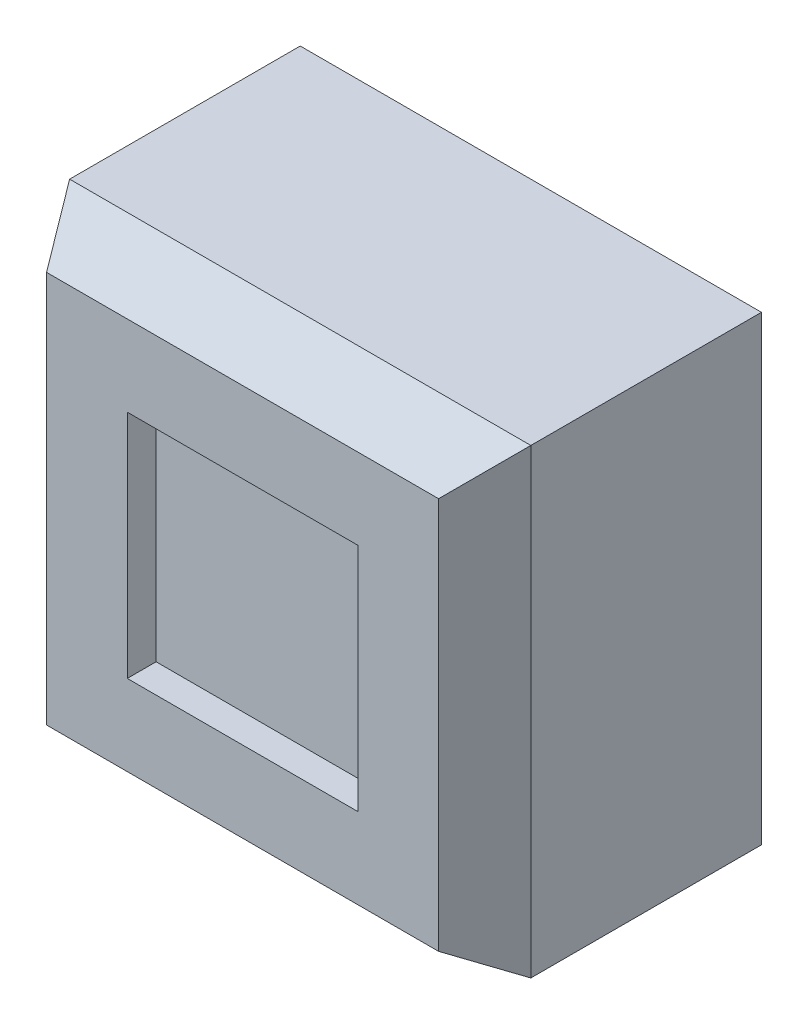
ISO-10303-21;
HEADER;
FILE_DESCRIPTION(('STEP AP214'),'2;1');
FILE_NAME('part.step','',(''),(''),'','','');
FILE_SCHEMA(('AUTOMOTIVE_DESIGN { 1 0 10303 214 1 1 1 1 }'));
ENDSEC;
DATA;
#1=APPLICATION_CONTEXT('core data for automotive mechanical design processes');
#2=APPLICATION_PROTOCOL_DEFINITION('international standard','automotive_design',2000,#1);
#3=PRODUCT_CONTEXT('',#1,'mechanical');
#4=PRODUCT('Part','Part','',(#3));
#5=PRODUCT_RELATED_PRODUCT_CATEGORY('part','',(#4));
#6=PRODUCT_DEFINITION_FORMATION('','',#4);
#7=PRODUCT_DEFINITION_CONTEXT('part definition',#1,'design');
#8=PRODUCT_DEFINITION('design','',#6,#7);
#9=PRODUCT_DEFINITION_SHAPE('','',#8);
#10=(LENGTH_UNIT() NAMED_UNIT(*) SI_UNIT(.MILLI.,.METRE.));
#11=(NAMED_UNIT(*) PLANE_ANGLE_UNIT() SI_UNIT($,.RADIAN.));
#12=(NAMED_UNIT(*) SI_UNIT($,.STERADIAN.) SOLID_ANGLE_UNIT());
#13=UNCERTAINTY_MEASURE_WITH_UNIT(LENGTH_MEASURE(1.E-05),#10,'distance_accuracy_value','');
#14=(GEOMETRIC_REPRESENTATION_CONTEXT(3) GLOBAL_UNCERTAINTY_ASSIGNED_CONTEXT((#13)) GLOBAL_UNIT_ASSIGNED_CONTEXT((#10,
#11,#12)) REPRESENTATION_CONTEXT('',''));
#15=CARTESIAN_POINT('',(0.,0.,0.));
#16=DIRECTION('',(0.,0.,1.));
#17=DIRECTION('',(1.,0.,0.));
#18=AXIS2_PLACEMENT_3D('',#15,#16,#17);
#19=CARTESIAN_POINT('',(0.,0.,10.));
#20=DIRECTION('',(1.,0.,0.));
#21=DIRECTION('',(0.,0.,-1.));
#22=AXIS2_PLACEMENT_3D('',#19,#20,#21);
#23=PLANE('',#22);
#24=DIRECTION('',(0.,0.,-1.));
#25=VECTOR('',#24,1.);
#26=CARTESIAN_POINT('',(0.,0.,10.));
#27=LINE('',#26,#25);
#28=CARTESIAN_POINT('',(0.,0.,8.));
#29=VERTEX_POINT('',#28);
#30=CARTESIAN_POINT('',(0.,0.,0.));
#31=VERTEX_POINT('',#30);
#32=EDGE_CURVE('E206',#29,#31,#27,.T.);
#33=ORIENTED_EDGE('',*,*,#32,.F.);
#34=DIRECTION('',(0.,1.,0.));
#35=VECTOR('',#34,1.);
#36=CARTESIAN_POINT('',(0.,0.,8.));
#37=LINE('',#36,#35);
#38=CARTESIAN_POINT('',(0.,16.,8.));
#39=VERTEX_POINT('',#38);
#40=EDGE_CURVE('E13',#29,#39,#37,.T.);
#41=ORIENTED_EDGE('',*,*,#40,.T.);
#42=DIRECTION('',(0.,0.,-1.));
#43=VECTOR('',#42,1.);
#44=CARTESIAN_POINT('',(0.,16.,10.));
#45=LINE('',#44,#43);
#46=CARTESIAN_POINT('',(0.,16.,0.));
#47=VERTEX_POINT('',#46);
#48=EDGE_CURVE('E197',#39,#47,#45,.T.);
#49=ORIENTED_EDGE('',*,*,#48,.T.);
#50=DIRECTION('',(0.,-1.,0.));
#51=VECTOR('',#50,1.);
#52=CARTESIAN_POINT('',(0.,0.,0.));
#53=LINE('',#52,#51);
#54=EDGE_CURVE('E176',#47,#31,#53,.T.);
#55=ORIENTED_EDGE('',*,*,#54,.T.);
#56=EDGE_LOOP('',(#33,#41,#49,#55));
#57=FACE_BOUND('',#56,.T.);
#58=ADVANCED_FACE('F48',(#57),#23,.F.);
#59=CARTESIAN_POINT('',(0.,0.,10.));
#60=DIRECTION('',(0.,1.,0.));
#61=DIRECTION('',(0.,0.,1.));
#62=AXIS2_PLACEMENT_3D('',#59,#60,#61);
#63=PLANE('',#62);
#64=DIRECTION('',(0.,0.,-1.));
#65=VECTOR('',#64,1.);
#66=CARTESIAN_POINT('',(16.,0.,10.));
#67=LINE('',#66,#65);
#68=CARTESIAN_POINT('',(16.,0.,8.));
#69=VERTEX_POINT('',#68);
#70=CARTESIAN_POINT('',(16.,0.,0.));
#71=VERTEX_POINT('',#70);
#72=EDGE_CURVE('E203',#69,#71,#67,.T.);
#73=ORIENTED_EDGE('',*,*,#72,.F.);
#74=DIRECTION('',(-1.,0.,0.));
#75=VECTOR('',#74,1.);
#76=CARTESIAN_POINT('',(0.,0.,8.));
#77=LINE('',#76,#75);
#78=EDGE_CURVE('E222',#69,#29,#77,.T.);
#79=ORIENTED_EDGE('',*,*,#78,.T.);
#80=ORIENTED_EDGE('',*,*,#32,.T.);
#81=DIRECTION('',(1.,0.,0.));
#82=VECTOR('',#81,1.);
#83=CARTESIAN_POINT('',(0.,0.,0.));
#84=LINE('',#83,#82);
#85=EDGE_CURVE('E185',#31,#71,#84,.T.);
#86=ORIENTED_EDGE('',*,*,#85,.T.);
#87=EDGE_LOOP('',(#73,#79,#80,#86));
#88=FACE_BOUND('',#87,.T.);
#89=ADVANCED_FACE('F259',(#88),#63,.F.);
#90=CARTESIAN_POINT('',(16.,0.,10.));
#91=DIRECTION('',(-1.,0.,0.));
#92=DIRECTION('',(0.,0.,1.));
#93=AXIS2_PLACEMENT_3D('',#90,#91,#92);
#94=PLANE('',#93);
#95=DIRECTION('',(0.,0.,-1.));
#96=VECTOR('',#95,1.);
#97=CARTESIAN_POINT('',(16.,16.,10.));
#98=LINE('',#97,#96);
#99=CARTESIAN_POINT('',(16.,16.,8.));
#100=VERTEX_POINT('',#99);
#101=CARTESIAN_POINT('',(16.,16.,0.));
#102=VERTEX_POINT('',#101);
#103=EDGE_CURVE('E200',#100,#102,#98,.T.);
#104=ORIENTED_EDGE('',*,*,#103,.F.);
#105=DIRECTION('',(0.,-1.,0.));
#106=VECTOR('',#105,1.);
#107=CARTESIAN_POINT('',(16.,0.,8.));
#108=LINE('',#107,#106);
#109=EDGE_CURVE('E226',#100,#69,#108,.T.);
#110=ORIENTED_EDGE('',*,*,#109,.T.);
#111=ORIENTED_EDGE('',*,*,#72,.T.);
#112=DIRECTION('',(0.,1.,0.));
#113=VECTOR('',#112,1.);
#114=CARTESIAN_POINT('',(16.,0.,0.));
#115=LINE('',#114,#113);
#116=EDGE_CURVE('E189',#71,#102,#115,.T.);
#117=ORIENTED_EDGE('',*,*,#116,.T.);
#118=EDGE_LOOP('',(#104,#110,#111,#117));
#119=FACE_BOUND('',#118,.T.);
#120=ADVANCED_FACE('F256',(#119),#94,.F.);
#121=CARTESIAN_POINT('',(0.,16.,10.));
#122=DIRECTION('',(0.,-1.,0.));
#123=DIRECTION('',(0.,0.,-1.));
#124=AXIS2_PLACEMENT_3D('',#121,#122,#123);
#125=PLANE('',#124);
#126=ORIENTED_EDGE('',*,*,#48,.F.);
#127=DIRECTION('',(1.,0.,0.));
#128=VECTOR('',#127,1.);
#129=CARTESIAN_POINT('',(0.,16.,8.));
#130=LINE('',#129,#128);
#131=EDGE_CURVE('E59',#39,#100,#130,.T.);
#132=ORIENTED_EDGE('',*,*,#131,.T.);
#133=ORIENTED_EDGE('',*,*,#103,.T.);
#134=DIRECTION('',(-1.,0.,0.));
#135=VECTOR('',#134,1.);
#136=CARTESIAN_POINT('',(0.,16.,0.));
#137=LINE('',#136,#135);
#138=EDGE_CURVE('E193',#102,#47,#137,.T.);
#139=ORIENTED_EDGE('',*,*,#138,.T.);
#140=EDGE_LOOP('',(#126,#132,#133,#139));
#141=FACE_BOUND('',#140,.T.);
#142=ADVANCED_FACE('F270',(#141),#125,.F.);
#143=CARTESIAN_POINT('',(0.,0.,10.));
#144=DIRECTION('',(0.,0.,-1.));
#145=DIRECTION('',(-1.,0.,0.));
#146=AXIS2_PLACEMENT_3D('',#143,#144,#145);
#147=PLANE('',#146);
#148=DIRECTION('',(0.,-1.,0.));
#149=VECTOR('',#148,1.);
#150=CARTESIAN_POINT('',(1.2,0.,10.));
#151=LINE('',#150,#149);
#152=CARTESIAN_POINT('',(1.2,14.8,10.));
#153=VERTEX_POINT('',#152);
#154=CARTESIAN_POINT('',(1.2,1.2,10.));
#155=VERTEX_POINT('',#154);
#156=EDGE_CURVE('E209',#153,#155,#151,.T.);
#157=ORIENTED_EDGE('',*,*,#156,.T.);
#158=DIRECTION('',(1.,0.,0.));
#159=VECTOR('',#158,1.);
#160=CARTESIAN_POINT('',(0.,1.2,10.));
#161=LINE('',#160,#159);
#162=CARTESIAN_POINT('',(14.8,1.2,10.));
#163=VERTEX_POINT('',#162);
#164=EDGE_CURVE('E218',#155,#163,#161,.T.);
#165=ORIENTED_EDGE('',*,*,#164,.T.);
#166=DIRECTION('',(0.,1.,0.));
#167=VECTOR('',#166,1.);
#168=CARTESIAN_POINT('',(14.8,0.,10.));
#169=LINE('',#168,#167);
#170=CARTESIAN_POINT('',(14.8,14.8,10.));
#171=VERTEX_POINT('',#170);
#172=EDGE_CURVE('E215',#163,#171,#169,.T.);
#173=ORIENTED_EDGE('',*,*,#172,.T.);
#174=DIRECTION('',(-1.,0.,0.));
#175=VECTOR('',#174,1.);
#176=CARTESIAN_POINT('',(0.,14.8,10.));
#177=LINE('',#176,#175);
#178=EDGE_CURVE('E212',#171,#153,#177,.T.);
#179=ORIENTED_EDGE('',*,*,#178,.T.);
#180=EDGE_LOOP('',(#157,#165,#173,#179));
#181=FACE_BOUND('',#180,.T.);
#182=DIRECTION('',(1.,0.,0.));
#183=VECTOR('',#182,1.);
#184=CARTESIAN_POINT('',(4.,4.,10.));
#185=LINE('',#184,#183);
#186=CARTESIAN_POINT('',(4.,4.,10.));
#187=VERTEX_POINT('',#186);
#188=CARTESIAN_POINT('',(12.,4.,10.));
#189=VERTEX_POINT('',#188);
#190=EDGE_CURVE('E167',#187,#189,#185,.T.);
#191=ORIENTED_EDGE('',*,*,#190,.F.);
#192=DIRECTION('',(0.,-1.,0.));
#193=VECTOR('',#192,1.);
#194=CARTESIAN_POINT('',(4.,12.,10.));
#195=LINE('',#194,#193);
#196=CARTESIAN_POINT('',(4.,12.,10.));
#197=VERTEX_POINT('',#196);
#198=EDGE_CURVE('E134',#197,#187,#195,.T.);
#199=ORIENTED_EDGE('',*,*,#198,.F.);
#200=DIRECTION('',(-1.,0.,0.));
#201=VECTOR('',#200,1.);
#202=CARTESIAN_POINT('',(4.,12.,10.));
#203=LINE('',#202,#201);
#204=CARTESIAN_POINT('',(12.,12.,10.));
#205=VERTEX_POINT('',#204);
#206=EDGE_CURVE('E154',#205,#197,#203,.T.);
#207=ORIENTED_EDGE('',*,*,#206,.F.);
#208=DIRECTION('',(0.,1.,0.));
#209=VECTOR('',#208,1.);
#210=CARTESIAN_POINT('',(12.,12.,10.));
#211=LINE('',#210,#209);
#212=EDGE_CURVE('E158',#189,#205,#211,.T.);
#213=ORIENTED_EDGE('',*,*,#212,.F.);
#214=EDGE_LOOP('',(#191,#199,#207,#213));
#215=FACE_BOUND('',#214,.T.);
#216=ADVANCED_FACE('F266',(#181,#215),#147,.F.);
#217=CARTESIAN_POINT('',(0.,0.,0.));
#218=DIRECTION('',(0.,0.,-1.));
#219=DIRECTION('',(-1.,0.,0.));
#220=AXIS2_PLACEMENT_3D('',#217,#218,#219);
#221=PLANE('',#220);
#222=ORIENTED_EDGE('',*,*,#54,.F.);
#223=ORIENTED_EDGE('',*,*,#138,.F.);
#224=ORIENTED_EDGE('',*,*,#116,.F.);
#225=ORIENTED_EDGE('',*,*,#85,.F.);
#226=EDGE_LOOP('',(#222,#223,#224,#225));
#227=FACE_BOUND('',#226,.T.);
#228=ADVANCED_FACE('F269',(#227),#221,.T.);
#229=CARTESIAN_POINT('',(4.,12.,9.));
#230=DIRECTION('',(-1.,0.,0.));
#231=DIRECTION('',(0.,-1.,0.));
#232=AXIS2_PLACEMENT_3D('',#229,#230,#231);
#233=PLANE('',#232);
#234=ORIENTED_EDGE('',*,*,#198,.T.);
#235=DIRECTION('',(0.,0.,1.));
#236=VECTOR('',#235,1.);
#237=CARTESIAN_POINT('',(4.,4.,9.));
#238=LINE('',#237,#236);
#239=CARTESIAN_POINT('',(4.,4.,9.));
#240=VERTEX_POINT('',#239);
#241=EDGE_CURVE('E127',#240,#187,#238,.T.);
#242=ORIENTED_EDGE('',*,*,#241,.F.);
#243=DIRECTION('',(0.,-1.,0.));
#244=VECTOR('',#243,1.);
#245=CARTESIAN_POINT('',(4.,12.,9.));
#246=LINE('',#245,#244);
#247=CARTESIAN_POINT('',(4.,12.,9.));
#248=VERTEX_POINT('',#247);
#249=EDGE_CURVE('E131',#248,#240,#246,.T.);
#250=ORIENTED_EDGE('',*,*,#249,.F.);
#251=DIRECTION('',(0.,0.,1.));
#252=VECTOR('',#251,1.);
#253=CARTESIAN_POINT('',(4.,12.,9.));
#254=LINE('',#253,#252);
#255=EDGE_CURVE('E173',#248,#197,#254,.T.);
#256=ORIENTED_EDGE('',*,*,#255,.T.);
#257=EDGE_LOOP('',(#234,#242,#250,#256));
#258=FACE_BOUND('',#257,.T.);
#259=ADVANCED_FACE('F129',(#258),#233,.F.);
#260=CARTESIAN_POINT('',(4.,12.,9.));
#261=DIRECTION('',(0.,1.,0.));
#262=DIRECTION('',(0.,0.,1.));
#263=AXIS2_PLACEMENT_3D('',#260,#261,#262);
#264=PLANE('',#263);
#265=ORIENTED_EDGE('',*,*,#206,.T.);
#266=ORIENTED_EDGE('',*,*,#255,.F.);
#267=DIRECTION('',(-1.,0.,0.));
#268=VECTOR('',#267,1.);
#269=CARTESIAN_POINT('',(4.,12.,9.));
#270=LINE('',#269,#268);
#271=CARTESIAN_POINT('',(12.,12.,9.));
#272=VERTEX_POINT('',#271);
#273=EDGE_CURVE('E140',#272,#248,#270,.T.);
#274=ORIENTED_EDGE('',*,*,#273,.F.);
#275=DIRECTION('',(0.,0.,1.));
#276=VECTOR('',#275,1.);
#277=CARTESIAN_POINT('',(12.,12.,9.));
#278=LINE('',#277,#276);
#279=EDGE_CURVE('E177',#272,#205,#278,.T.);
#280=ORIENTED_EDGE('',*,*,#279,.T.);
#281=EDGE_LOOP('',(#265,#266,#274,#280));
#282=FACE_BOUND('',#281,.T.);
#283=ADVANCED_FACE('F277',(#282),#264,.F.);
#284=CARTESIAN_POINT('',(12.,12.,9.));
#285=DIRECTION('',(1.,0.,0.));
#286=DIRECTION('',(0.,1.,0.));
#287=AXIS2_PLACEMENT_3D('',#284,#285,#286);
#288=PLANE('',#287);
#289=ORIENTED_EDGE('',*,*,#212,.T.);
#290=ORIENTED_EDGE('',*,*,#279,.F.);
#291=DIRECTION('',(0.,1.,0.));
#292=VECTOR('',#291,1.);
#293=CARTESIAN_POINT('',(12.,12.,9.));
#294=LINE('',#293,#292);
#295=CARTESIAN_POINT('',(12.,4.,9.));
#296=VERTEX_POINT('',#295);
#297=EDGE_CURVE('E149',#296,#272,#294,.T.);
#298=ORIENTED_EDGE('',*,*,#297,.F.);
#299=DIRECTION('',(0.,0.,1.));
#300=VECTOR('',#299,1.);
#301=CARTESIAN_POINT('',(12.,4.,9.));
#302=LINE('',#301,#300);
#303=EDGE_CURVE('E139',#296,#189,#302,.T.);
#304=ORIENTED_EDGE('',*,*,#303,.T.);
#305=EDGE_LOOP('',(#289,#290,#298,#304));
#306=FACE_BOUND('',#305,.T.);
#307=ADVANCED_FACE('F275',(#306),#288,.F.);
#308=CARTESIAN_POINT('',(4.,4.,9.));
#309=DIRECTION('',(0.,-1.,0.));
#310=DIRECTION('',(0.,0.,-1.));
#311=AXIS2_PLACEMENT_3D('',#308,#309,#310);
#312=PLANE('',#311);
#313=ORIENTED_EDGE('',*,*,#190,.T.);
#314=ORIENTED_EDGE('',*,*,#303,.F.);
#315=DIRECTION('',(1.,0.,0.));
#316=VECTOR('',#315,1.);
#317=CARTESIAN_POINT('',(4.,4.,9.));
#318=LINE('',#317,#316);
#319=EDGE_CURVE('E143',#240,#296,#318,.T.);
#320=ORIENTED_EDGE('',*,*,#319,.F.);
#321=ORIENTED_EDGE('',*,*,#241,.T.);
#322=EDGE_LOOP('',(#313,#314,#320,#321));
#323=FACE_BOUND('',#322,.T.);
#324=ADVANCED_FACE('F144',(#323),#312,.F.);
#325=CARTESIAN_POINT('',(0.,0.,9.));
#326=DIRECTION('',(0.,0.,1.));
#327=DIRECTION('',(1.,0.,0.));
#328=AXIS2_PLACEMENT_3D('',#325,#326,#327);
#329=PLANE('',#328);
#330=ORIENTED_EDGE('',*,*,#249,.T.);
#331=ORIENTED_EDGE('',*,*,#319,.T.);
#332=ORIENTED_EDGE('',*,*,#297,.T.);
#333=ORIENTED_EDGE('',*,*,#273,.T.);
#334=EDGE_LOOP('',(#330,#331,#332,#333));
#335=FACE_BOUND('',#334,.T.);
#336=ADVANCED_FACE('F151',(#335),#329,.T.);
#337=CARTESIAN_POINT('',(0.,14.8,10.));
#338=DIRECTION('',(0.,-0.857492925712544,-0.514495755427526));
#339=DIRECTION('',(-1.,0.,0.));
#340=AXIS2_PLACEMENT_3D('',#337,#338,#339);
#341=PLANE('',#340);
#342=DIRECTION('',(0.457495710997814,0.457495710997814,-0.762492851663023));
#343=VECTOR('',#342,1.);
#344=CARTESIAN_POINT('',(11.7023255813953,11.7023255813954,15.1627906976744));
#345=LINE('',#344,#343);
#346=EDGE_CURVE('E236',#100,#171,#345,.F.);
#347=ORIENTED_EDGE('',*,*,#346,.F.);
#348=ORIENTED_EDGE('',*,*,#131,.F.);
#349=DIRECTION('',(-0.457495710997814,0.457495710997814,-0.762492851663023));
#350=VECTOR('',#349,1.);
#351=CARTESIAN_POINT('',(4.29767441860465,11.7023255813954,15.1627906976744));
#352=LINE('',#351,#350);
#353=EDGE_CURVE('E53',#153,#39,#352,.T.);
#354=ORIENTED_EDGE('',*,*,#353,.F.);
#355=ORIENTED_EDGE('',*,*,#178,.F.);
#356=EDGE_LOOP('',(#347,#348,#354,#355));
#357=FACE_BOUND('',#356,.T.);
#358=ADVANCED_FACE('F51',(#357),#341,.F.);
#359=CARTESIAN_POINT('',(1.2,0.,10.));
#360=DIRECTION('',(0.857492925712544,0.,-0.514495755427526));
#361=DIRECTION('',(0.,-1.,0.));
#362=AXIS2_PLACEMENT_3D('',#359,#360,#361);
#363=PLANE('',#362);
#364=ORIENTED_EDGE('',*,*,#353,.T.);
#365=ORIENTED_EDGE('',*,*,#40,.F.);
#366=DIRECTION('',(0.457495710997814,0.457495710997814,0.762492851663023));
#367=VECTOR('',#366,1.);
#368=CARTESIAN_POINT('',(0.948837209302326,0.948837209302325,9.58139534883721));
#369=LINE('',#368,#367);
#370=EDGE_CURVE('E234',#155,#29,#369,.F.);
#371=ORIENTED_EDGE('',*,*,#370,.F.);
#372=ORIENTED_EDGE('',*,*,#156,.F.);
#373=EDGE_LOOP('',(#364,#365,#371,#372));
#374=FACE_BOUND('',#373,.T.);
#375=ADVANCED_FACE('F248',(#374),#363,.F.);
#376=CARTESIAN_POINT('',(14.8,0.,10.));
#377=DIRECTION('',(-0.857492925712544,0.,-0.514495755427526));
#378=DIRECTION('',(0.,1.,0.));
#379=AXIS2_PLACEMENT_3D('',#376,#377,#378);
#380=PLANE('',#379);
#381=ORIENTED_EDGE('',*,*,#346,.T.);
#382=ORIENTED_EDGE('',*,*,#172,.F.);
#383=DIRECTION('',(0.457495710997814,-0.457495710997814,-0.762492851663023));
#384=VECTOR('',#383,1.);
#385=CARTESIAN_POINT('',(15.0511627906977,0.948837209302326,9.58139534883721));
#386=LINE('',#385,#384);
#387=EDGE_CURVE('E231',#69,#163,#386,.F.);
#388=ORIENTED_EDGE('',*,*,#387,.F.);
#389=ORIENTED_EDGE('',*,*,#109,.F.);
#390=EDGE_LOOP('',(#381,#382,#388,#389));
#391=FACE_BOUND('',#390,.T.);
#392=ADVANCED_FACE('F253',(#391),#380,.F.);
#393=CARTESIAN_POINT('',(0.,1.2,10.));
#394=DIRECTION('',(0.,0.857492925712544,-0.514495755427526));
#395=DIRECTION('',(1.,0.,0.));
#396=AXIS2_PLACEMENT_3D('',#393,#394,#395);
#397=PLANE('',#396);
#398=ORIENTED_EDGE('',*,*,#370,.T.);
#399=ORIENTED_EDGE('',*,*,#78,.F.);
#400=ORIENTED_EDGE('',*,*,#387,.T.);
#401=ORIENTED_EDGE('',*,*,#164,.F.);
#402=EDGE_LOOP('',(#398,#399,#400,#401));
#403=FACE_BOUND('',#402,.T.);
#404=ADVANCED_FACE('F263',(#403),#397,.F.);
#405=CLOSED_SHELL('',(#58,#89,#120,#142,#216,#228,#259,#283,#307,#324,#336,#358,#375,#392,#404));
#406=MANIFOLD_SOLID_BREP('B2',#405);
#407=ADVANCED_BREP_SHAPE_REPRESENTATION('',(#18,#406),#14);
#408=SHAPE_DEFINITION_REPRESENTATION(#9,#407);
ENDSEC;
END-ISO-10303-21;
